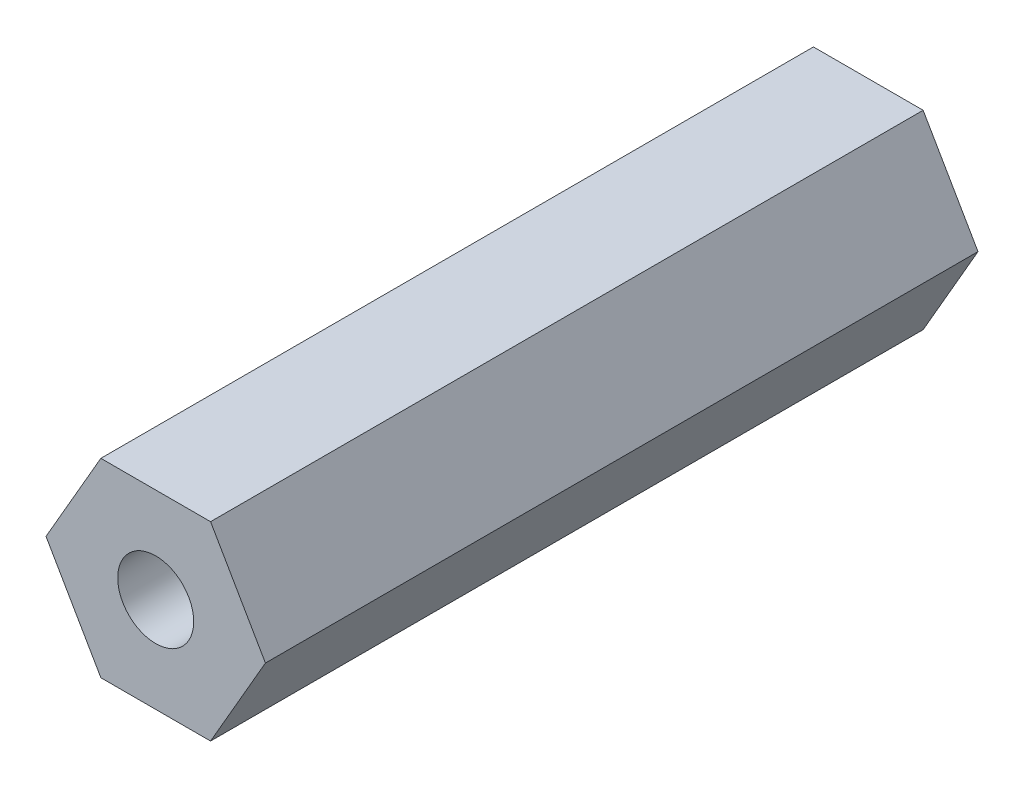
ISO-10303-21;
HEADER;
FILE_DESCRIPTION(('STEP AP214'),'2;1');
FILE_NAME('part.step','',(''),(''),'','','');
FILE_SCHEMA(('AUTOMOTIVE_DESIGN { 1 0 10303 214 1 1 1 1 }'));
ENDSEC;
DATA;
#1=APPLICATION_CONTEXT('core data for automotive mechanical design processes');
#2=APPLICATION_PROTOCOL_DEFINITION('international standard','automotive_design',2000,#1);
#3=PRODUCT_CONTEXT('',#1,'mechanical');
#4=PRODUCT('Part','Part','',(#3));
#5=PRODUCT_RELATED_PRODUCT_CATEGORY('part','',(#4));
#6=PRODUCT_DEFINITION_FORMATION('','',#4);
#7=PRODUCT_DEFINITION_CONTEXT('part definition',#1,'design');
#8=PRODUCT_DEFINITION('design','',#6,#7);
#9=PRODUCT_DEFINITION_SHAPE('','',#8);
#10=(LENGTH_UNIT() NAMED_UNIT(*) SI_UNIT(.MILLI.,.METRE.));
#11=(NAMED_UNIT(*) PLANE_ANGLE_UNIT() SI_UNIT($,.RADIAN.));
#12=(NAMED_UNIT(*) SI_UNIT($,.STERADIAN.) SOLID_ANGLE_UNIT());
#13=UNCERTAINTY_MEASURE_WITH_UNIT(LENGTH_MEASURE(1.E-05),#10,'distance_accuracy_value','');
#14=(GEOMETRIC_REPRESENTATION_CONTEXT(3) GLOBAL_UNCERTAINTY_ASSIGNED_CONTEXT((#13)) GLOBAL_UNIT_ASSIGNED_CONTEXT((#10,
#11,#12)) REPRESENTATION_CONTEXT('',''));
#15=CARTESIAN_POINT('',(0.,0.,0.));
#16=DIRECTION('',(0.,0.,1.));
#17=DIRECTION('',(1.,0.,0.));
#18=AXIS2_PLACEMENT_3D('',#15,#16,#17);
#19=CARTESIAN_POINT('',(2.3094010767585,0.,15.));
#20=DIRECTION('',(-0.866025403784438,-0.5,0.));
#21=DIRECTION('',(0.5,-0.866025403784439,0.));
#22=AXIS2_PLACEMENT_3D('',#19,#20,#21);
#23=PLANE('',#22);
#24=DIRECTION('',(-0.5,0.866025403784438,0.));
#25=VECTOR('',#24,1.);
#26=CARTESIAN_POINT('',(2.3094010767585,0.,0.));
#27=LINE('',#26,#25);
#28=CARTESIAN_POINT('',(2.3094010767585,0.,0.));
#29=VERTEX_POINT('',#28);
#30=CARTESIAN_POINT('',(1.15470053837925,2.,0.));
#31=VERTEX_POINT('',#30);
#32=EDGE_CURVE('E120',#29,#31,#27,.T.);
#33=ORIENTED_EDGE('',*,*,#32,.T.);
#34=DIRECTION('',(0.,0.,-1.));
#35=VECTOR('',#34,1.);
#36=CARTESIAN_POINT('',(1.15470053837925,2.,15.));
#37=LINE('',#36,#35);
#38=CARTESIAN_POINT('',(1.15470053837925,2.,15.));
#39=VERTEX_POINT('',#38);
#40=EDGE_CURVE('E11',#39,#31,#37,.T.);
#41=ORIENTED_EDGE('',*,*,#40,.F.);
#42=DIRECTION('',(-0.5,0.866025403784438,0.));
#43=VECTOR('',#42,1.);
#44=CARTESIAN_POINT('',(2.3094010767585,0.,15.));
#45=LINE('',#44,#43);
#46=CARTESIAN_POINT('',(2.3094010767585,0.,15.));
#47=VERTEX_POINT('',#46);
#48=EDGE_CURVE('E131',#47,#39,#45,.T.);
#49=ORIENTED_EDGE('',*,*,#48,.F.);
#50=DIRECTION('',(0.,0.,-1.));
#51=VECTOR('',#50,1.);
#52=CARTESIAN_POINT('',(2.3094010767585,0.,15.));
#53=LINE('',#52,#51);
#54=EDGE_CURVE('E116',#47,#29,#53,.T.);
#55=ORIENTED_EDGE('',*,*,#54,.T.);
#56=EDGE_LOOP('',(#33,#41,#49,#55));
#57=FACE_BOUND('',#56,.T.);
#58=ADVANCED_FACE('F36',(#57),#23,.F.);
#59=CARTESIAN_POINT('',(1.15470053837925,2.,15.));
#60=DIRECTION('',(0.,-1.,0.));
#61=DIRECTION('',(1.,0.,0.));
#62=AXIS2_PLACEMENT_3D('',#59,#60,#61);
#63=PLANE('',#62);
#64=DIRECTION('',(-1.,0.,0.));
#65=VECTOR('',#64,1.);
#66=CARTESIAN_POINT('',(1.15470053837925,2.,0.));
#67=LINE('',#66,#65);
#68=CARTESIAN_POINT('',(-1.15470053837925,2.,0.));
#69=VERTEX_POINT('',#68);
#70=EDGE_CURVE('E123',#31,#69,#67,.T.);
#71=ORIENTED_EDGE('',*,*,#70,.T.);
#72=DIRECTION('',(0.,0.,-1.));
#73=VECTOR('',#72,1.);
#74=CARTESIAN_POINT('',(-1.15470053837925,2.,15.));
#75=LINE('',#74,#73);
#76=CARTESIAN_POINT('',(-1.15470053837925,2.,15.));
#77=VERTEX_POINT('',#76);
#78=EDGE_CURVE('E44',#77,#69,#75,.T.);
#79=ORIENTED_EDGE('',*,*,#78,.F.);
#80=DIRECTION('',(-1.,0.,0.));
#81=VECTOR('',#80,1.);
#82=CARTESIAN_POINT('',(1.15470053837925,2.,15.));
#83=LINE('',#82,#81);
#84=EDGE_CURVE('E89',#39,#77,#83,.T.);
#85=ORIENTED_EDGE('',*,*,#84,.F.);
#86=ORIENTED_EDGE('',*,*,#40,.T.);
#87=EDGE_LOOP('',(#71,#79,#85,#86));
#88=FACE_BOUND('',#87,.T.);
#89=ADVANCED_FACE('F156',(#88),#63,.F.);
#90=CARTESIAN_POINT('',(-1.15470053837925,2.,15.));
#91=DIRECTION('',(0.866025403784439,-0.499999999999999,0.));
#92=DIRECTION('',(0.5,0.866025403784439,0.));
#93=AXIS2_PLACEMENT_3D('',#90,#91,#92);
#94=PLANE('',#93);
#95=DIRECTION('',(-0.499999999999999,-0.866025403784439,0.));
#96=VECTOR('',#95,1.);
#97=CARTESIAN_POINT('',(-1.15470053837925,2.,0.));
#98=LINE('',#97,#96);
#99=CARTESIAN_POINT('',(-2.3094010767585,0.,0.));
#100=VERTEX_POINT('',#99);
#101=EDGE_CURVE('E126',#69,#100,#98,.T.);
#102=ORIENTED_EDGE('',*,*,#101,.T.);
#103=DIRECTION('',(0.,0.,-1.));
#104=VECTOR('',#103,1.);
#105=CARTESIAN_POINT('',(-2.3094010767585,0.,15.));
#106=LINE('',#105,#104);
#107=CARTESIAN_POINT('',(-2.3094010767585,0.,15.));
#108=VERTEX_POINT('',#107);
#109=EDGE_CURVE('E111',#108,#100,#106,.T.);
#110=ORIENTED_EDGE('',*,*,#109,.F.);
#111=DIRECTION('',(-0.499999999999999,-0.866025403784439,0.));
#112=VECTOR('',#111,1.);
#113=CARTESIAN_POINT('',(-1.15470053837925,2.,15.));
#114=LINE('',#113,#112);
#115=EDGE_CURVE('E102',#77,#108,#114,.T.);
#116=ORIENTED_EDGE('',*,*,#115,.F.);
#117=ORIENTED_EDGE('',*,*,#78,.T.);
#118=EDGE_LOOP('',(#102,#110,#116,#117));
#119=FACE_BOUND('',#118,.T.);
#120=ADVANCED_FACE('F137',(#119),#94,.F.);
#121=CARTESIAN_POINT('',(-2.3094010767585,0.,15.));
#122=DIRECTION('',(0.866025403784438,0.5,0.));
#123=DIRECTION('',(-0.5,0.866025403784439,0.));
#124=AXIS2_PLACEMENT_3D('',#121,#122,#123);
#125=PLANE('',#124);
#126=DIRECTION('',(0.5,-0.866025403784438,0.));
#127=VECTOR('',#126,1.);
#128=CARTESIAN_POINT('',(-2.3094010767585,0.,0.));
#129=LINE('',#128,#127);
#130=CARTESIAN_POINT('',(-1.15470053837925,-2.,0.));
#131=VERTEX_POINT('',#130);
#132=EDGE_CURVE('E110',#100,#131,#129,.T.);
#133=ORIENTED_EDGE('',*,*,#132,.T.);
#134=DIRECTION('',(0.,0.,-1.));
#135=VECTOR('',#134,1.);
#136=CARTESIAN_POINT('',(-1.15470053837925,-2.,15.));
#137=LINE('',#136,#135);
#138=CARTESIAN_POINT('',(-1.15470053837925,-2.,15.));
#139=VERTEX_POINT('',#138);
#140=EDGE_CURVE('E107',#139,#131,#137,.T.);
#141=ORIENTED_EDGE('',*,*,#140,.F.);
#142=DIRECTION('',(0.5,-0.866025403784438,0.));
#143=VECTOR('',#142,1.);
#144=CARTESIAN_POINT('',(-2.3094010767585,0.,15.));
#145=LINE('',#144,#143);
#146=EDGE_CURVE('E96',#108,#139,#145,.T.);
#147=ORIENTED_EDGE('',*,*,#146,.F.);
#148=ORIENTED_EDGE('',*,*,#109,.T.);
#149=EDGE_LOOP('',(#133,#141,#147,#148));
#150=FACE_BOUND('',#149,.T.);
#151=ADVANCED_FACE('F108',(#150),#125,.F.);
#152=CARTESIAN_POINT('',(-1.15470053837925,-2.,15.));
#153=DIRECTION('',(0.,1.,0.));
#154=DIRECTION('',(-1.,0.,0.));
#155=AXIS2_PLACEMENT_3D('',#152,#153,#154);
#156=PLANE('',#155);
#157=DIRECTION('',(1.,0.,0.));
#158=VECTOR('',#157,1.);
#159=CARTESIAN_POINT('',(-1.15470053837925,-2.,0.));
#160=LINE('',#159,#158);
#161=CARTESIAN_POINT('',(1.15470053837925,-2.,0.));
#162=VERTEX_POINT('',#161);
#163=EDGE_CURVE('E75',#131,#162,#160,.T.);
#164=ORIENTED_EDGE('',*,*,#163,.T.);
#165=DIRECTION('',(0.,0.,-1.));
#166=VECTOR('',#165,1.);
#167=CARTESIAN_POINT('',(1.15470053837925,-2.,15.));
#168=LINE('',#167,#166);
#169=CARTESIAN_POINT('',(1.15470053837925,-2.,15.));
#170=VERTEX_POINT('',#169);
#171=EDGE_CURVE('E112',#170,#162,#168,.T.);
#172=ORIENTED_EDGE('',*,*,#171,.F.);
#173=DIRECTION('',(1.,0.,0.));
#174=VECTOR('',#173,1.);
#175=CARTESIAN_POINT('',(-1.15470053837925,-2.,15.));
#176=LINE('',#175,#174);
#177=EDGE_CURVE('E100',#139,#170,#176,.T.);
#178=ORIENTED_EDGE('',*,*,#177,.F.);
#179=ORIENTED_EDGE('',*,*,#140,.T.);
#180=EDGE_LOOP('',(#164,#172,#178,#179));
#181=FACE_BOUND('',#180,.T.);
#182=ADVANCED_FACE('F114',(#181),#156,.F.);
#183=CARTESIAN_POINT('',(1.15470053837925,-2.,15.));
#184=DIRECTION('',(-0.866025403784439,0.5,0.));
#185=DIRECTION('',(-0.5,-0.866025403784439,0.));
#186=AXIS2_PLACEMENT_3D('',#183,#184,#185);
#187=PLANE('',#186);
#188=DIRECTION('',(0.5,0.866025403784439,0.));
#189=VECTOR('',#188,1.);
#190=CARTESIAN_POINT('',(1.15470053837925,-2.,0.));
#191=LINE('',#190,#189);
#192=EDGE_CURVE('E81',#162,#29,#191,.T.);
#193=ORIENTED_EDGE('',*,*,#192,.T.);
#194=ORIENTED_EDGE('',*,*,#54,.F.);
#195=DIRECTION('',(0.5,0.866025403784439,0.));
#196=VECTOR('',#195,1.);
#197=CARTESIAN_POINT('',(1.15470053837925,-2.,15.));
#198=LINE('',#197,#196);
#199=EDGE_CURVE('E52',#170,#47,#198,.T.);
#200=ORIENTED_EDGE('',*,*,#199,.F.);
#201=ORIENTED_EDGE('',*,*,#171,.T.);
#202=EDGE_LOOP('',(#193,#194,#200,#201));
#203=FACE_BOUND('',#202,.T.);
#204=ADVANCED_FACE('F144',(#203),#187,.F.);
#205=CARTESIAN_POINT('',(0.,0.,15.));
#206=DIRECTION('',(0.,0.,1.));
#207=DIRECTION('',(1.,0.,0.));
#208=AXIS2_PLACEMENT_3D('',#205,#206,#207);
#209=PLANE('',#208);
#210=CARTESIAN_POINT('',(0.,0.,15.));
#211=DIRECTION('',(0.,0.,1.));
#212=DIRECTION('',(1.,0.,0.));
#213=AXIS2_PLACEMENT_3D('',#210,#211,#212);
#214=CIRCLE('',#213,0.799999999999998);
#215=CARTESIAN_POINT('',(0.799999999999998,0.,15.));
#216=VERTEX_POINT('',#215);
#217=EDGE_CURVE('E213',#216,#216,#214,.T.);
#218=ORIENTED_EDGE('',*,*,#217,.F.);
#219=EDGE_LOOP('',(#218));
#220=FACE_BOUND('',#219,.T.);
#221=ORIENTED_EDGE('',*,*,#48,.T.);
#222=ORIENTED_EDGE('',*,*,#84,.T.);
#223=ORIENTED_EDGE('',*,*,#115,.T.);
#224=ORIENTED_EDGE('',*,*,#146,.T.);
#225=ORIENTED_EDGE('',*,*,#177,.T.);
#226=ORIENTED_EDGE('',*,*,#199,.T.);
#227=EDGE_LOOP('',(#221,#222,#223,#224,#225,#226));
#228=FACE_BOUND('',#227,.T.);
#229=ADVANCED_FACE('F98',(#220,#228),#209,.T.);
#230=CARTESIAN_POINT('',(0.,0.,0.));
#231=DIRECTION('',(0.,0.,1.));
#232=DIRECTION('',(1.,0.,0.));
#233=AXIS2_PLACEMENT_3D('',#230,#231,#232);
#234=PLANE('',#233);
#235=CARTESIAN_POINT('',(0.,0.,0.));
#236=DIRECTION('',(0.,0.,1.));
#237=DIRECTION('',(1.,0.,0.));
#238=AXIS2_PLACEMENT_3D('',#235,#236,#237);
#239=CIRCLE('',#238,0.799999999999996);
#240=CARTESIAN_POINT('',(0.799999999999996,0.,0.));
#241=VERTEX_POINT('',#240);
#242=EDGE_CURVE('E124',#241,#241,#239,.T.);
#243=ORIENTED_EDGE('',*,*,#242,.T.);
#244=EDGE_LOOP('',(#243));
#245=FACE_BOUND('',#244,.T.);
#246=ORIENTED_EDGE('',*,*,#32,.F.);
#247=ORIENTED_EDGE('',*,*,#192,.F.);
#248=ORIENTED_EDGE('',*,*,#163,.F.);
#249=ORIENTED_EDGE('',*,*,#132,.F.);
#250=ORIENTED_EDGE('',*,*,#101,.F.);
#251=ORIENTED_EDGE('',*,*,#70,.F.);
#252=EDGE_LOOP('',(#246,#247,#248,#249,#250,#251));
#253=FACE_BOUND('',#252,.T.);
#254=ADVANCED_FACE('F140',(#245,#253),#234,.F.);
#255=CARTESIAN_POINT('',(0.,0.,15.));
#256=DIRECTION('',(0.,0.,1.));
#257=DIRECTION('',(1.,0.,0.));
#258=AXIS2_PLACEMENT_3D('',#255,#256,#257);
#259=CYLINDRICAL_SURFACE('',#258,0.799999999999997);
#260=ORIENTED_EDGE('',*,*,#242,.F.);
#261=EDGE_LOOP('',(#260));
#262=FACE_BOUND('',#261,.T.);
#263=ORIENTED_EDGE('',*,*,#217,.T.);
#264=EDGE_LOOP('',(#263));
#265=FACE_BOUND('',#264,.T.);
#266=ADVANCED_FACE('F193',(#262,#265),#259,.F.);
#267=CLOSED_SHELL('',(#58,#89,#120,#151,#182,#204,#229,#254,#266));
#268=MANIFOLD_SOLID_BREP('B2',#267);
#269=ADVANCED_BREP_SHAPE_REPRESENTATION('',(#18,#268),#14);
#270=SHAPE_DEFINITION_REPRESENTATION(#9,#269);
ENDSEC;
END-ISO-10303-21;
